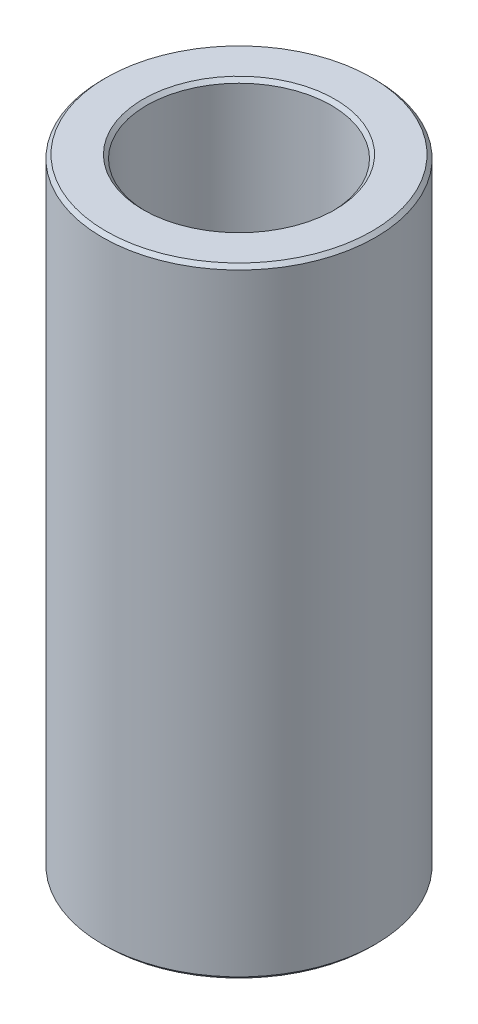
ISO-10303-21;
HEADER;
FILE_DESCRIPTION(('STEP AP214'),'2;1');
FILE_NAME('part.step','',(''),(''),'','','');
FILE_SCHEMA(('AUTOMOTIVE_DESIGN { 1 0 10303 214 1 1 1 1 }'));
ENDSEC;
DATA;
#1=APPLICATION_CONTEXT('core data for automotive mechanical design processes');
#2=APPLICATION_PROTOCOL_DEFINITION('international standard','automotive_design',2000,#1);
#3=PRODUCT_CONTEXT('',#1,'mechanical');
#4=PRODUCT('Part','Part','',(#3));
#5=PRODUCT_RELATED_PRODUCT_CATEGORY('part','',(#4));
#6=PRODUCT_DEFINITION_FORMATION('','',#4);
#7=PRODUCT_DEFINITION_CONTEXT('part definition',#1,'design');
#8=PRODUCT_DEFINITION('design','',#6,#7);
#9=PRODUCT_DEFINITION_SHAPE('','',#8);
#10=(LENGTH_UNIT() NAMED_UNIT(*) SI_UNIT(.MILLI.,.METRE.));
#11=(NAMED_UNIT(*) PLANE_ANGLE_UNIT() SI_UNIT($,.RADIAN.));
#12=(NAMED_UNIT(*) SI_UNIT($,.STERADIAN.) SOLID_ANGLE_UNIT());
#13=UNCERTAINTY_MEASURE_WITH_UNIT(LENGTH_MEASURE(1.E-05),#10,'distance_accuracy_value','');
#14=(GEOMETRIC_REPRESENTATION_CONTEXT(3) GLOBAL_UNCERTAINTY_ASSIGNED_CONTEXT((#13)) GLOBAL_UNIT_ASSIGNED_CONTEXT((#10,
#11,#12)) REPRESENTATION_CONTEXT('',''));
#15=CARTESIAN_POINT('',(0.,0.,0.));
#16=DIRECTION('',(0.,0.,1.));
#17=DIRECTION('',(1.,0.,0.));
#18=AXIS2_PLACEMENT_3D('',#15,#16,#17);
#19=CARTESIAN_POINT('',(0.,113.382845756054,0.));
#20=DIRECTION('',(0.,-1.,0.));
#21=DIRECTION('',(0.,0.,-1.));
#22=AXIS2_PLACEMENT_3D('',#19,#20,#21);
#23=CYLINDRICAL_SURFACE('',#22,25.);
#24=CARTESIAN_POINT('',(0.,0.654447395131,0.));
#25=DIRECTION('',(0.,1.,0.));
#26=DIRECTION('',(0.,0.,1.));
#27=AXIS2_PLACEMENT_3D('',#24,#25,#26);
#28=CIRCLE('',#27,25.);
#29=CARTESIAN_POINT('',(0.,0.654447395131,-25.));
#30=VERTEX_POINT('',#29);
#31=EDGE_CURVE('E10',#30,#30,#28,.T.);
#32=CARTESIAN_POINT('',(0.,112.728398360923,0.));
#33=DIRECTION('',(0.,1.,0.));
#34=DIRECTION('',(0.,0.,1.));
#35=AXIS2_PLACEMENT_3D('',#32,#33,#34);
#36=CIRCLE('',#35,25.);
#37=CARTESIAN_POINT('',(0.,112.728398360923,-25.));
#38=VERTEX_POINT('',#37);
#39=EDGE_CURVE('E50',#38,#38,#36,.F.);
#40=CARTESIAN_POINT('',(0.,0.654447395131,-25.));
#41=CARTESIAN_POINT('',(0.,1.821884384358,-25.));
#42=CARTESIAN_POINT('',(0.,2.98932137358501,-25.));
#43=CARTESIAN_POINT('',(0.,5.32419535203901,-25.));
#44=CARTESIAN_POINT('',(0.,6.49163234126601,-25.));
#45=CARTESIAN_POINT('',(0.,8.82650631972002,-25.));
#46=CARTESIAN_POINT('',(0.,9.99394330894702,-25.));
#47=CARTESIAN_POINT('',(0.,12.328817287401,-25.));
#48=CARTESIAN_POINT('',(0.,13.496254276628,-25.));
#49=CARTESIAN_POINT('',(0.,15.831128255082,-25.));
#50=CARTESIAN_POINT('',(0.,16.998565244309,-25.));
#51=CARTESIAN_POINT('',(0.,19.333439222763,-25.));
#52=CARTESIAN_POINT('',(0.,20.50087621199,-25.));
#53=CARTESIAN_POINT('',(0.,22.835750190444,-25.));
#54=CARTESIAN_POINT('',(0.,24.003187179671,-25.));
#55=CARTESIAN_POINT('',(0.,26.3380611581251,-25.));
#56=CARTESIAN_POINT('',(0.,27.505498147352,-25.));
#57=CARTESIAN_POINT('',(0.,29.8403721258061,-25.));
#58=CARTESIAN_POINT('',(0.,31.0078091150331,-25.));
#59=CARTESIAN_POINT('',(0.,33.3426830934871,-25.));
#60=CARTESIAN_POINT('',(0.,34.5101200827141,-25.));
#61=CARTESIAN_POINT('',(0.,36.8449940611681,-25.));
#62=CARTESIAN_POINT('',(0.,38.0124310503951,-25.));
#63=CARTESIAN_POINT('',(0.,40.3473050288491,-25.));
#64=CARTESIAN_POINT('',(0.,41.5147420180761,-25.));
#65=CARTESIAN_POINT('',(0.,43.8496159965301,-25.));
#66=CARTESIAN_POINT('',(0.,45.0170529857571,-25.));
#67=CARTESIAN_POINT('',(0.,47.3519269642111,-25.));
#68=CARTESIAN_POINT('',(0.,48.5193639534381,-25.));
#69=CARTESIAN_POINT('',(0.,50.8542379318921,-25.));
#70=CARTESIAN_POINT('',(0.,52.0216749211191,-25.));
#71=CARTESIAN_POINT('',(0.,54.3565488995731,-25.));
#72=CARTESIAN_POINT('',(0.,55.5239858888001,-25.));
#73=CARTESIAN_POINT('',(0.,57.8588598672541,-25.));
#74=CARTESIAN_POINT('',(0.,59.0262968564811,-25.));
#75=CARTESIAN_POINT('',(0.,61.3611708349351,-25.));
#76=CARTESIAN_POINT('',(0.,62.5286078241621,-25.));
#77=CARTESIAN_POINT('',(0.,64.8634818026161,-25.));
#78=CARTESIAN_POINT('',(0.,66.0309187918431,-25.));
#79=CARTESIAN_POINT('',(0.,68.3657927702971,-25.));
#80=CARTESIAN_POINT('',(0.,69.5332297595241,-25.));
#81=CARTESIAN_POINT('',(0.,71.8681037379781,-25.));
#82=CARTESIAN_POINT('',(0.,73.0355407272051,-25.));
#83=CARTESIAN_POINT('',(0.,75.3704147056591,-25.));
#84=CARTESIAN_POINT('',(0.,76.5378516948861,-25.));
#85=CARTESIAN_POINT('',(0.,78.8727256733401,-25.));
#86=CARTESIAN_POINT('',(0.,80.0401626625671,-25.));
#87=CARTESIAN_POINT('',(0.,82.3750366410211,-25.));
#88=CARTESIAN_POINT('',(0.,83.5424736302482,-25.));
#89=CARTESIAN_POINT('',(0.,85.8773476087022,-25.));
#90=CARTESIAN_POINT('',(0.,87.0447845979292,-25.));
#91=CARTESIAN_POINT('',(0.,89.3796585763832,-25.));
#92=CARTESIAN_POINT('',(0.,90.5470955656102,-25.));
#93=CARTESIAN_POINT('',(0.,92.8819695440642,-25.));
#94=CARTESIAN_POINT('',(0.,94.0494065332912,-25.));
#95=CARTESIAN_POINT('',(0.,96.3842805117452,-25.));
#96=CARTESIAN_POINT('',(0.,97.5517175009722,-25.));
#97=CARTESIAN_POINT('',(0.,99.8865914794262,-25.));
#98=CARTESIAN_POINT('',(0.,101.054028468653,-25.));
#99=CARTESIAN_POINT('',(0.,103.388902447107,-25.));
#100=CARTESIAN_POINT('',(0.,104.556339436334,-25.));
#101=CARTESIAN_POINT('',(0.,106.891213414788,-25.));
#102=CARTESIAN_POINT('',(0.,108.058650404015,-25.));
#103=CARTESIAN_POINT('',(0.,110.393524382469,-25.));
#104=CARTESIAN_POINT('',(0.,111.560961371696,-25.));
#105=CARTESIAN_POINT('',(0.,112.728398360923,-25.));
#106=B_SPLINE_CURVE_WITH_KNOTS('',3,(#40,#41,#42,#43,#44,#45,#46,#47,#48,#49,#50,#51,#52,#53,
#54,#55,#56,#57,#58,#59,#60,#61,#62,#63,#64,#65,#66,#67,#68,#69,#70,#71,#72,#73,#74,#75,#76,#77,
#78,#79,#80,#81,#82,#83,#84,#85,#86,#87,#88,#89,#90,#91,#92,#93,#94,#95,#96,#97,#98,#99,#100,
#101,#102,#103,#104,#105),.UNSPECIFIED.,.F.,.F.,(4,2,2,2,2,2,2,2,2,2,2,2,2,2,2,2,2,2,2,2,2,2,2,
2,2,2,2,2,2,2,2,2,4),(0.,3.50231096768101,7.00462193536201,10.506932903043,14.009243870724,
17.511554838405,21.013865806086,24.5161767737671,28.0184877414481,31.5207987091291,
35.0231096768101,38.5254206444911,42.0277316121721,45.5300425798531,49.0323535475341,
52.5346645152151,56.0369754828961,59.5392864505771,63.0415974182581,66.5439083859391,
70.0462193536201,73.5485303213011,77.0508412889821,80.5531522566631,84.0554632243442,
87.5577741920251,91.0600851597062,94.5623961273872,98.0647070950682,101.567018062749,
105.06932903043,108.571639998111,112.073950965792),.UNSPECIFIED.);
#107=EDGE_CURVE('BSEAM39',#30,#38,#106,.T.);
#108=ORIENTED_EDGE('',*,*,#31,.T.);
#109=ORIENTED_EDGE('',*,*,#39,.T.);
#110=ORIENTED_EDGE('',*,*,#107,.T.);
#111=ORIENTED_EDGE('',*,*,#107,.F.);
#112=EDGE_LOOP('',(#108,#110,#109,#111));
#113=FACE_BOUND('',#112,.T.);
#114=ADVANCED_FACE('F39',(#113),#23,.T.);
#115=CARTESIAN_POINT('',(0.,113.382845756054,0.));
#116=DIRECTION('',(0.,1.,0.));
#117=DIRECTION('',(0.,0.,1.));
#118=AXIS2_PLACEMENT_3D('',#115,#116,#117);
#119=PLANE('',#118);
#120=CARTESIAN_POINT('',(0.,113.382845756054,0.));
#121=DIRECTION('',(0.,1.,0.));
#122=DIRECTION('',(0.,0.,1.));
#123=AXIS2_PLACEMENT_3D('',#120,#121,#122);
#124=CIRCLE('',#123,17.5537590225181);
#125=CARTESIAN_POINT('',(0.,113.382845756054,17.5537590225181));
#126=VERTEX_POINT('',#125);
#127=EDGE_CURVE('E58',#126,#126,#124,.F.);
#128=ORIENTED_EDGE('',*,*,#127,.T.);
#129=EDGE_LOOP('',(#128));
#130=FACE_BOUND('',#129,.T.);
#131=CARTESIAN_POINT('',(0.,113.382845756054,0.));
#132=DIRECTION('',(0.,1.,0.));
#133=DIRECTION('',(0.,0.,1.));
#134=AXIS2_PLACEMENT_3D('',#131,#132,#133);
#135=CIRCLE('',#134,24.3455526048692);
#136=CARTESIAN_POINT('',(0.,113.382845756054,24.3455526048692));
#137=VERTEX_POINT('',#136);
#138=EDGE_CURVE('E61',#137,#137,#135,.T.);
#139=ORIENTED_EDGE('',*,*,#138,.T.);
#140=EDGE_LOOP('',(#139));
#141=FACE_BOUND('',#140,.T.);
#142=ADVANCED_FACE('F88',(#130,#141),#119,.T.);
#143=CARTESIAN_POINT('',(0.,0.,0.));
#144=DIRECTION('',(0.,1.,0.));
#145=DIRECTION('',(0.,0.,1.));
#146=AXIS2_PLACEMENT_3D('',#143,#144,#145);
#147=PLANE('',#146);
#148=CARTESIAN_POINT('',(0.,0.,0.));
#149=DIRECTION('',(0.,1.,0.));
#150=DIRECTION('',(0.,0.,1.));
#151=AXIS2_PLACEMENT_3D('',#148,#149,#150);
#152=CIRCLE('',#151,17.553759022518);
#153=CARTESIAN_POINT('',(0.,0.,17.553759022518));
#154=VERTEX_POINT('',#153);
#155=EDGE_CURVE('E51',#154,#154,#152,.T.);
#156=ORIENTED_EDGE('',*,*,#155,.T.);
#157=EDGE_LOOP('',(#156));
#158=FACE_BOUND('',#157,.T.);
#159=CARTESIAN_POINT('',(0.,0.,0.));
#160=DIRECTION('',(0.,1.,0.));
#161=DIRECTION('',(0.,0.,1.));
#162=AXIS2_PLACEMENT_3D('',#159,#160,#161);
#163=CIRCLE('',#162,24.345552604869);
#164=CARTESIAN_POINT('',(0.,0.,24.345552604869));
#165=VERTEX_POINT('',#164);
#166=EDGE_CURVE('E54',#165,#165,#163,.F.);
#167=ORIENTED_EDGE('',*,*,#166,.T.);
#168=EDGE_LOOP('',(#167));
#169=FACE_BOUND('',#168,.T.);
#170=ADVANCED_FACE('F83',(#158,#169),#147,.F.);
#171=CARTESIAN_POINT('',(0.,113.382845756054,0.));
#172=DIRECTION('',(0.,-1.,0.));
#173=DIRECTION('',(0.,0.,-1.));
#174=AXIS2_PLACEMENT_3D('',#171,#172,#173);
#175=CYLINDRICAL_SURFACE('',#174,16.8993116273871);
#176=CARTESIAN_POINT('',(0.,112.728398360923,0.));
#177=DIRECTION('',(0.,1.,0.));
#178=DIRECTION('',(0.,0.,1.));
#179=AXIS2_PLACEMENT_3D('',#176,#177,#178);
#180=CIRCLE('',#179,16.8993116273871);
#181=CARTESIAN_POINT('',(0.,112.728398360923,-16.8993116273871));
#182=VERTEX_POINT('',#181);
#183=EDGE_CURVE('E67',#182,#182,#180,.T.);
#184=CARTESIAN_POINT('',(0.,0.654447395130903,0.));
#185=DIRECTION('',(0.,1.,0.));
#186=DIRECTION('',(0.,0.,1.));
#187=AXIS2_PLACEMENT_3D('',#184,#185,#186);
#188=CIRCLE('',#187,16.8993116273871);
#189=CARTESIAN_POINT('',(0.,0.654447395130889,-16.8993116273871));
#190=VERTEX_POINT('',#189);
#191=EDGE_CURVE('E69',#190,#190,#188,.F.);
#192=CARTESIAN_POINT('',(0.,112.728398360923,-16.8993116273871));
#193=CARTESIAN_POINT('',(0.,111.560961371696,-16.8993116273871));
#194=CARTESIAN_POINT('',(0.,110.393524382469,-16.8993116273871));
#195=CARTESIAN_POINT('',(0.,108.058650404015,-16.8993116273871));
#196=CARTESIAN_POINT('',(0.,106.891213414788,-16.8993116273871));
#197=CARTESIAN_POINT('',(0.,104.556339436334,-16.8993116273871));
#198=CARTESIAN_POINT('',(0.,103.388902447107,-16.8993116273871));
#199=CARTESIAN_POINT('',(0.,101.054028468653,-16.8993116273871));
#200=CARTESIAN_POINT('',(0.,99.8865914794261,-16.8993116273871));
#201=CARTESIAN_POINT('',(0.,97.5517175009721,-16.8993116273871));
#202=CARTESIAN_POINT('',(0.,96.3842805117451,-16.8993116273871));
#203=CARTESIAN_POINT('',(0.,94.0494065332911,-16.8993116273871));
#204=CARTESIAN_POINT('',(0.,92.8819695440641,-16.8993116273871));
#205=CARTESIAN_POINT('',(0.,90.5470955656101,-16.8993116273871));
#206=CARTESIAN_POINT('',(0.,89.3796585763831,-16.8993116273871));
#207=CARTESIAN_POINT('',(0.,87.0447845979291,-16.8993116273871));
#208=CARTESIAN_POINT('',(0.,85.8773476087021,-16.8993116273871));
#209=CARTESIAN_POINT('',(0.,83.5424736302481,-16.8993116273871));
#210=CARTESIAN_POINT('',(0.,82.3750366410211,-16.8993116273871));
#211=CARTESIAN_POINT('',(0.,80.0401626625671,-16.8993116273871));
#212=CARTESIAN_POINT('',(0.,78.8727256733401,-16.8993116273871));
#213=CARTESIAN_POINT('',(0.,76.5378516948861,-16.8993116273871));
#214=CARTESIAN_POINT('',(0.,75.3704147056591,-16.8993116273871));
#215=CARTESIAN_POINT('',(0.,73.0355407272051,-16.8993116273871));
#216=CARTESIAN_POINT('',(0.,71.868103737978,-16.8993116273871));
#217=CARTESIAN_POINT('',(0.,69.533229759524,-16.8993116273871));
#218=CARTESIAN_POINT('',(0.,68.365792770297,-16.8993116273871));
#219=CARTESIAN_POINT('',(0.,66.030918791843,-16.8993116273871));
#220=CARTESIAN_POINT('',(0.,64.863481802616,-16.8993116273871));
#221=CARTESIAN_POINT('',(0.,62.528607824162,-16.8993116273871));
#222=CARTESIAN_POINT('',(0.,61.361170834935,-16.8993116273871));
#223=CARTESIAN_POINT('',(0.,59.026296856481,-16.8993116273871));
#224=CARTESIAN_POINT('',(0.,57.858859867254,-16.8993116273871));
#225=CARTESIAN_POINT('',(0.,55.5239858888,-16.8993116273871));
#226=CARTESIAN_POINT('',(0.,54.356548899573,-16.8993116273871));
#227=CARTESIAN_POINT('',(0.,52.021674921119,-16.8993116273871));
#228=CARTESIAN_POINT('',(0.,50.854237931892,-16.8993116273871));
#229=CARTESIAN_POINT('',(0.,48.519363953438,-16.8993116273871));
#230=CARTESIAN_POINT('',(0.,47.351926964211,-16.8993116273871));
#231=CARTESIAN_POINT('',(0.,45.017052985757,-16.8993116273871));
#232=CARTESIAN_POINT('',(0.,43.84961599653,-16.8993116273871));
#233=CARTESIAN_POINT('',(0.,41.514742018076,-16.8993116273871));
#234=CARTESIAN_POINT('',(0.,40.347305028849,-16.8993116273871));
#235=CARTESIAN_POINT('',(0.,38.012431050395,-16.8993116273871));
#236=CARTESIAN_POINT('',(0.,36.844994061168,-16.8993116273871));
#237=CARTESIAN_POINT('',(0.,34.510120082714,-16.8993116273871));
#238=CARTESIAN_POINT('',(0.,33.342683093487,-16.8993116273871));
#239=CARTESIAN_POINT('',(0.,31.007809115033,-16.8993116273871));
#240=CARTESIAN_POINT('',(0.,29.840372125806,-16.8993116273871));
#241=CARTESIAN_POINT('',(0.,27.505498147352,-16.8993116273871));
#242=CARTESIAN_POINT('',(0.,26.3380611581249,-16.8993116273871));
#243=CARTESIAN_POINT('',(0.,24.0031871796709,-16.8993116273871));
#244=CARTESIAN_POINT('',(0.,22.8357501904439,-16.8993116273871));
#245=CARTESIAN_POINT('',(0.,20.5008762119899,-16.8993116273871));
#246=CARTESIAN_POINT('',(0.,19.3334392227629,-16.8993116273871));
#247=CARTESIAN_POINT('',(0.,16.9985652443089,-16.8993116273871));
#248=CARTESIAN_POINT('',(0.,15.8311282550819,-16.8993116273871));
#249=CARTESIAN_POINT('',(0.,13.4962542766279,-16.8993116273871));
#250=CARTESIAN_POINT('',(0.,12.3288172874009,-16.8993116273871));
#251=CARTESIAN_POINT('',(0.,9.99394330894691,-16.8993116273871));
#252=CARTESIAN_POINT('',(0.,8.82650631971991,-16.8993116273871));
#253=CARTESIAN_POINT('',(0.,6.4916323412659,-16.8993116273871));
#254=CARTESIAN_POINT('',(0.,5.3241953520389,-16.8993116273871));
#255=CARTESIAN_POINT('',(0.,2.9893213735849,-16.8993116273871));
#256=CARTESIAN_POINT('',(0.,1.82188438435789,-16.8993116273871));
#257=CARTESIAN_POINT('',(0.,0.654447395130889,-16.8993116273871));
#258=B_SPLINE_CURVE_WITH_KNOTS('',3,(#192,#193,#194,#195,#196,#197,#198,#199,#200,#201,#202,
#203,#204,#205,#206,#207,#208,#209,#210,#211,#212,#213,#214,#215,#216,#217,#218,#219,#220,#221,
#222,#223,#224,#225,#226,#227,#228,#229,#230,#231,#232,#233,#234,#235,#236,#237,#238,#239,#240,
#241,#242,#243,#244,#245,#246,#247,#248,#249,#250,#251,#252,#253,#254,#255,#256,#257),
.UNSPECIFIED.,.F.,.F.,(4,2,2,2,2,2,2,2,2,2,2,2,2,2,2,2,2,2,2,2,2,2,2,2,2,2,2,2,2,2,2,2,4),(0.,
3.502310967681,7.00462193536201,10.506932903043,14.009243870724,17.511554838405,21.013865806086,
24.516176773767,28.0184877414481,31.5207987091291,35.0231096768101,38.5254206444911,
42.0277316121721,45.5300425798531,49.0323535475341,52.5346645152151,56.0369754828961,
59.5392864505771,63.0415974182581,66.5439083859391,70.0462193536201,73.5485303213011,
77.0508412889822,80.5531522566632,84.0554632243442,87.5577741920252,91.0600851597062,
94.5623961273872,98.0647070950682,101.567018062749,105.06932903043,108.571639998111,
112.073950965792),.UNSPECIFIED.);
#259=EDGE_CURVE('BSEAM71',#182,#190,#258,.T.);
#260=ORIENTED_EDGE('',*,*,#183,.T.);
#261=ORIENTED_EDGE('',*,*,#191,.T.);
#262=ORIENTED_EDGE('',*,*,#259,.T.);
#263=ORIENTED_EDGE('',*,*,#259,.F.);
#264=EDGE_LOOP('',(#260,#262,#261,#263));
#265=FACE_BOUND('',#264,.T.);
#266=ADVANCED_FACE('F71',(#265),#175,.F.);
#267=CARTESIAN_POINT('',(0.,112.728398360923,0.));
#268=DIRECTION('',(0.,1.,0.));
#269=DIRECTION('',(0.,0.,1.));
#270=AXIS2_PLACEMENT_3D('',#267,#268,#269);
#271=CONICAL_SURFACE('',#270,16.8993116273871,0.785398163397443);
#272=ORIENTED_EDGE('',*,*,#127,.F.);
#273=EDGE_LOOP('',(#272));
#274=FACE_BOUND('',#273,.T.);
#275=ORIENTED_EDGE('',*,*,#183,.F.);
#276=EDGE_LOOP('',(#275));
#277=FACE_BOUND('',#276,.T.);
#278=ADVANCED_FACE('F77',(#274,#277),#271,.F.);
#279=CARTESIAN_POINT('',(0.,0.,0.));
#280=DIRECTION('',(0.,-1.,0.));
#281=DIRECTION('',(0.,0.,-1.));
#282=AXIS2_PLACEMENT_3D('',#279,#280,#281);
#283=CONICAL_SURFACE('',#282,17.553759022518,0.785398163397443);
#284=ORIENTED_EDGE('',*,*,#191,.F.);
#285=EDGE_LOOP('',(#284));
#286=FACE_BOUND('',#285,.T.);
#287=ORIENTED_EDGE('',*,*,#155,.F.);
#288=EDGE_LOOP('',(#287));
#289=FACE_BOUND('',#288,.T.);
#290=ADVANCED_FACE('F73',(#286,#289),#283,.F.);
#291=CARTESIAN_POINT('',(0.,0.654447395131,0.));
#292=DIRECTION('',(0.,1.,0.));
#293=DIRECTION('',(0.,0.,1.));
#294=AXIS2_PLACEMENT_3D('',#291,#292,#293);
#295=CONICAL_SURFACE('',#294,25.,0.785398163397456);
#296=ORIENTED_EDGE('',*,*,#166,.F.);
#297=EDGE_LOOP('',(#296));
#298=FACE_BOUND('',#297,.T.);
#299=ORIENTED_EDGE('',*,*,#31,.F.);
#300=EDGE_LOOP('',(#299));
#301=FACE_BOUND('',#300,.T.);
#302=ADVANCED_FACE('F76',(#298,#301),#295,.T.);
#303=CARTESIAN_POINT('',(0.,113.382845756054,0.));
#304=DIRECTION('',(0.,-1.,0.));
#305=DIRECTION('',(0.,0.,-1.));
#306=AXIS2_PLACEMENT_3D('',#303,#304,#305);
#307=CONICAL_SURFACE('',#306,24.3455526048692,0.785398163397424);
#308=ORIENTED_EDGE('',*,*,#39,.F.);
#309=EDGE_LOOP('',(#308));
#310=FACE_BOUND('',#309,.T.);
#311=ORIENTED_EDGE('',*,*,#138,.F.);
#312=EDGE_LOOP('',(#311));
#313=FACE_BOUND('',#312,.T.);
#314=ADVANCED_FACE('F45',(#310,#313),#307,.T.);
#315=CLOSED_SHELL('',(#114,#142,#170,#266,#278,#290,#302,#314));
#316=MANIFOLD_SOLID_BREP('B2',#315);
#317=ADVANCED_BREP_SHAPE_REPRESENTATION('',(#18,#316),#14);
#318=SHAPE_DEFINITION_REPRESENTATION(#9,#317);
ENDSEC;
END-ISO-10303-21;
